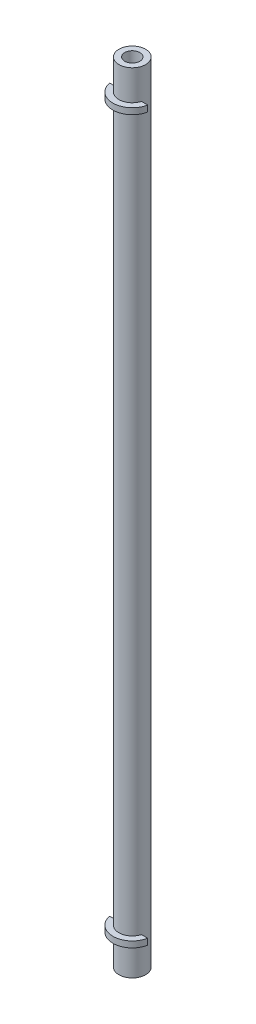
ISO-10303-21;
HEADER;
FILE_DESCRIPTION(('STEP AP214'),'2;1');
FILE_NAME('part.step','',(''),(''),'','','');
FILE_SCHEMA(('AUTOMOTIVE_DESIGN { 1 0 10303 214 1 1 1 1 }'));
ENDSEC;
DATA;
#1=APPLICATION_CONTEXT('core data for automotive mechanical design processes');
#2=APPLICATION_PROTOCOL_DEFINITION('international standard','automotive_design',2000,#1);
#3=PRODUCT_CONTEXT('',#1,'mechanical');
#4=PRODUCT('Part','Part','',(#3));
#5=PRODUCT_RELATED_PRODUCT_CATEGORY('part','',(#4));
#6=PRODUCT_DEFINITION_FORMATION('','',#4);
#7=PRODUCT_DEFINITION_CONTEXT('part definition',#1,'design');
#8=PRODUCT_DEFINITION('design','',#6,#7);
#9=PRODUCT_DEFINITION_SHAPE('','',#8);
#10=(LENGTH_UNIT() NAMED_UNIT(*) SI_UNIT(.MILLI.,.METRE.));
#11=(NAMED_UNIT(*) PLANE_ANGLE_UNIT() SI_UNIT($,.RADIAN.));
#12=(NAMED_UNIT(*) SI_UNIT($,.STERADIAN.) SOLID_ANGLE_UNIT());
#13=UNCERTAINTY_MEASURE_WITH_UNIT(LENGTH_MEASURE(1.E-05),#10,'distance_accuracy_value','');
#14=(GEOMETRIC_REPRESENTATION_CONTEXT(3) GLOBAL_UNCERTAINTY_ASSIGNED_CONTEXT((#13)) GLOBAL_UNIT_ASSIGNED_CONTEXT((#10,
#11,#12)) REPRESENTATION_CONTEXT('',''));
#15=CARTESIAN_POINT('',(0.,0.,0.));
#16=DIRECTION('',(0.,0.,1.));
#17=DIRECTION('',(1.,0.,0.));
#18=AXIS2_PLACEMENT_3D('',#15,#16,#17);
#19=CARTESIAN_POINT('',(0.,165.1,0.));
#20=DIRECTION('',(0.,-1.,0.));
#21=DIRECTION('',(0.,0.,-1.));
#22=AXIS2_PLACEMENT_3D('',#19,#20,#21);
#23=CYLINDRICAL_SURFACE('',#22,2.794);
#24=CARTESIAN_POINT('',(0.,7.62,0.));
#25=DIRECTION('',(0.,1.,0.));
#26=DIRECTION('',(0.,0.,-1.));
#27=AXIS2_PLACEMENT_3D('',#24,#25,#26);
#28=CIRCLE('',#27,2.794);
#29=CARTESIAN_POINT('',(-2.68808333204162,7.62,0.762000000000001));
#30=VERTEX_POINT('',#29);
#31=CARTESIAN_POINT('',(2.68808333204162,7.62,0.762));
#32=VERTEX_POINT('',#31);
#33=EDGE_CURVE('E167',#30,#32,#28,.T.);
#34=ORIENTED_EDGE('',*,*,#33,.T.);
#35=DIRECTION('',(0.,-1.,0.));
#36=VECTOR('',#35,1.);
#37=CARTESIAN_POINT('',(2.68808333204162,7.62,0.762));
#38=LINE('',#37,#36);
#39=CARTESIAN_POINT('',(2.68808333204162,6.35,0.762));
#40=VERTEX_POINT('',#39);
#41=EDGE_CURVE('E190',#32,#40,#38,.T.);
#42=ORIENTED_EDGE('',*,*,#41,.T.);
#43=CARTESIAN_POINT('',(0.,6.35,0.));
#44=DIRECTION('',(0.,1.,0.));
#45=DIRECTION('',(0.,0.,-1.));
#46=AXIS2_PLACEMENT_3D('',#43,#44,#45);
#47=CIRCLE('',#46,2.794);
#48=CARTESIAN_POINT('',(-2.68808333204162,6.34999999999999,0.762));
#49=VERTEX_POINT('',#48);
#50=EDGE_CURVE('E180',#49,#40,#47,.T.);
#51=ORIENTED_EDGE('',*,*,#50,.F.);
#52=DIRECTION('',(0.,-1.,0.));
#53=VECTOR('',#52,1.);
#54=CARTESIAN_POINT('',(-2.68808333204162,7.62,0.762000000000001));
#55=LINE('',#54,#53);
#56=EDGE_CURVE('E194',#30,#49,#55,.T.);
#57=ORIENTED_EDGE('',*,*,#56,.F.);
#58=EDGE_LOOP('',(#34,#42,#51,#57));
#59=FACE_BOUND('',#58,.T.);
#60=CARTESIAN_POINT('',(0.,165.1,0.));
#61=DIRECTION('',(0.,1.,0.));
#62=DIRECTION('',(0.,0.,1.));
#63=AXIS2_PLACEMENT_3D('',#60,#61,#62);
#64=CIRCLE('',#63,2.794);
#65=CARTESIAN_POINT('',(0.,165.1,2.794));
#66=VERTEX_POINT('',#65);
#67=EDGE_CURVE('E11',#66,#66,#64,.T.);
#68=ORIENTED_EDGE('',*,*,#67,.F.);
#69=EDGE_LOOP('',(#68));
#70=FACE_BOUND('',#69,.T.);
#71=CARTESIAN_POINT('',(0.,0.,0.));
#72=DIRECTION('',(0.,1.,0.));
#73=DIRECTION('',(0.,0.,1.));
#74=AXIS2_PLACEMENT_3D('',#71,#72,#73);
#75=CIRCLE('',#74,2.794);
#76=CARTESIAN_POINT('',(0.,0.,2.794));
#77=VERTEX_POINT('',#76);
#78=EDGE_CURVE('E42',#77,#77,#75,.T.);
#79=ORIENTED_EDGE('',*,*,#78,.T.);
#80=EDGE_LOOP('',(#79));
#81=FACE_BOUND('',#80,.T.);
#82=CARTESIAN_POINT('',(0.,157.48,0.));
#83=DIRECTION('',(0.,1.,0.));
#84=DIRECTION('',(0.,0.,-1.));
#85=AXIS2_PLACEMENT_3D('',#82,#83,#84);
#86=CIRCLE('',#85,2.794);
#87=CARTESIAN_POINT('',(-2.68808333204162,157.48,0.762000000000001));
#88=VERTEX_POINT('',#87);
#89=CARTESIAN_POINT('',(2.68808333204162,157.48,0.762));
#90=VERTEX_POINT('',#89);
#91=EDGE_CURVE('E113',#88,#90,#86,.T.);
#92=ORIENTED_EDGE('',*,*,#91,.F.);
#93=DIRECTION('',(0.,1.,0.));
#94=VECTOR('',#93,1.);
#95=CARTESIAN_POINT('',(-2.68808333204162,157.48,0.762000000000001));
#96=LINE('',#95,#94);
#97=CARTESIAN_POINT('',(-2.68808333204162,158.75,0.762000000000001));
#98=VERTEX_POINT('',#97);
#99=EDGE_CURVE('E152',#88,#98,#96,.T.);
#100=ORIENTED_EDGE('',*,*,#99,.T.);
#101=CARTESIAN_POINT('',(0.,158.75,0.));
#102=DIRECTION('',(0.,1.,0.));
#103=DIRECTION('',(0.,0.,-1.));
#104=AXIS2_PLACEMENT_3D('',#101,#102,#103);
#105=CIRCLE('',#104,2.794);
#106=CARTESIAN_POINT('',(2.68808333204162,158.75,0.762));
#107=VERTEX_POINT('',#106);
#108=EDGE_CURVE('E134',#98,#107,#105,.T.);
#109=ORIENTED_EDGE('',*,*,#108,.T.);
#110=DIRECTION('',(0.,1.,0.));
#111=VECTOR('',#110,1.);
#112=CARTESIAN_POINT('',(2.68808333204162,157.48,0.762));
#113=LINE('',#112,#111);
#114=EDGE_CURVE('E124',#90,#107,#113,.T.);
#115=ORIENTED_EDGE('',*,*,#114,.F.);
#116=EDGE_LOOP('',(#92,#100,#109,#115));
#117=FACE_BOUND('',#116,.T.);
#118=ADVANCED_FACE('F39',(#59,#70,#81,#117),#23,.T.);
#119=CARTESIAN_POINT('',(0.,165.1,0.));
#120=DIRECTION('',(0.,1.,0.));
#121=DIRECTION('',(0.,0.,1.));
#122=AXIS2_PLACEMENT_3D('',#119,#120,#121);
#123=PLANE('',#122);
#124=ORIENTED_EDGE('',*,*,#67,.T.);
#125=EDGE_LOOP('',(#124));
#126=FACE_BOUND('',#125,.T.);
#127=CARTESIAN_POINT('',(0.,165.1,0.));
#128=DIRECTION('',(0.,1.,0.));
#129=DIRECTION('',(0.,0.,1.));
#130=AXIS2_PLACEMENT_3D('',#127,#128,#129);
#131=CIRCLE('',#130,1.5875);
#132=CARTESIAN_POINT('',(0.,165.1,1.5875));
#133=VERTEX_POINT('',#132);
#134=EDGE_CURVE('E199',#133,#133,#131,.T.);
#135=ORIENTED_EDGE('',*,*,#134,.F.);
#136=EDGE_LOOP('',(#135));
#137=FACE_BOUND('',#136,.T.);
#138=ADVANCED_FACE('F221',(#126,#137),#123,.T.);
#139=CARTESIAN_POINT('',(0.,0.,0.));
#140=DIRECTION('',(0.,1.,0.));
#141=DIRECTION('',(0.,0.,1.));
#142=AXIS2_PLACEMENT_3D('',#139,#140,#141);
#143=PLANE('',#142);
#144=ORIENTED_EDGE('',*,*,#78,.F.);
#145=EDGE_LOOP('',(#144));
#146=FACE_BOUND('',#145,.T.);
#147=CARTESIAN_POINT('',(0.,0.,0.));
#148=DIRECTION('',(0.,1.,0.));
#149=DIRECTION('',(0.,0.,1.));
#150=AXIS2_PLACEMENT_3D('',#147,#148,#149);
#151=CIRCLE('',#150,1.5875);
#152=CARTESIAN_POINT('',(0.,0.,1.5875));
#153=VERTEX_POINT('',#152);
#154=EDGE_CURVE('E189',#153,#153,#151,.T.);
#155=ORIENTED_EDGE('',*,*,#154,.T.);
#156=EDGE_LOOP('',(#155));
#157=FACE_BOUND('',#156,.T.);
#158=ADVANCED_FACE('F207',(#146,#157),#143,.F.);
#159=CARTESIAN_POINT('',(0.,165.1,0.));
#160=DIRECTION('',(0.,-1.,0.));
#161=DIRECTION('',(0.,0.,-1.));
#162=AXIS2_PLACEMENT_3D('',#159,#160,#161);
#163=CYLINDRICAL_SURFACE('',#162,1.5875);
#164=ORIENTED_EDGE('',*,*,#134,.T.);
#165=EDGE_LOOP('',(#164));
#166=FACE_BOUND('',#165,.T.);
#167=ORIENTED_EDGE('',*,*,#154,.F.);
#168=EDGE_LOOP('',(#167));
#169=FACE_BOUND('',#168,.T.);
#170=ADVANCED_FACE('F209',(#166,#169),#163,.F.);
#171=CARTESIAN_POINT('',(0.,7.62,0.));
#172=DIRECTION('',(0.,-1.,0.));
#173=DIRECTION('',(0.,0.,-1.));
#174=AXIS2_PLACEMENT_3D('',#171,#172,#173);
#175=CYLINDRICAL_SURFACE('',#174,4.064);
#176=CARTESIAN_POINT('',(0.,6.35,0.));
#177=DIRECTION('',(0.,-1.,0.));
#178=DIRECTION('',(0.,0.,-1.));
#179=AXIS2_PLACEMENT_3D('',#176,#177,#178);
#180=CIRCLE('',#179,4.064);
#181=CARTESIAN_POINT('',(3.99192334595743,6.35,0.762));
#182=VERTEX_POINT('',#181);
#183=CARTESIAN_POINT('',(-3.99192334595743,6.35,0.762));
#184=VERTEX_POINT('',#183);
#185=EDGE_CURVE('E151',#182,#184,#180,.T.);
#186=ORIENTED_EDGE('',*,*,#185,.F.);
#187=DIRECTION('',(0.,-1.,0.));
#188=VECTOR('',#187,1.);
#189=CARTESIAN_POINT('',(3.99192334595743,7.62,0.762));
#190=LINE('',#189,#188);
#191=CARTESIAN_POINT('',(3.99192334595743,7.62,0.762));
#192=VERTEX_POINT('',#191);
#193=EDGE_CURVE('E186',#192,#182,#190,.T.);
#194=ORIENTED_EDGE('',*,*,#193,.F.);
#195=CARTESIAN_POINT('',(0.,7.62,0.));
#196=DIRECTION('',(0.,-1.,0.));
#197=DIRECTION('',(0.,0.,-1.));
#198=AXIS2_PLACEMENT_3D('',#195,#196,#197);
#199=CIRCLE('',#198,4.064);
#200=CARTESIAN_POINT('',(-3.99192334595743,7.62,0.762));
#201=VERTEX_POINT('',#200);
#202=EDGE_CURVE('E158',#192,#201,#199,.T.);
#203=ORIENTED_EDGE('',*,*,#202,.T.);
#204=DIRECTION('',(0.,-1.,0.));
#205=VECTOR('',#204,1.);
#206=CARTESIAN_POINT('',(-3.99192334595743,7.62,0.762));
#207=LINE('',#206,#205);
#208=EDGE_CURVE('E175',#201,#184,#207,.T.);
#209=ORIENTED_EDGE('',*,*,#208,.T.);
#210=EDGE_LOOP('',(#186,#194,#203,#209));
#211=FACE_BOUND('',#210,.T.);
#212=ADVANCED_FACE('F211',(#211),#175,.T.);
#213=CARTESIAN_POINT('',(3.99192334595743,7.62,0.762));
#214=DIRECTION('',(0.,0.,-1.));
#215=DIRECTION('',(-1.,0.,0.));
#216=AXIS2_PLACEMENT_3D('',#213,#214,#215);
#217=PLANE('',#216);
#218=DIRECTION('',(1.,0.,0.));
#219=VECTOR('',#218,1.);
#220=CARTESIAN_POINT('',(3.99192334595743,6.35,0.762));
#221=LINE('',#220,#219);
#222=EDGE_CURVE('E163',#40,#182,#221,.T.);
#223=ORIENTED_EDGE('',*,*,#222,.F.);
#224=ORIENTED_EDGE('',*,*,#41,.F.);
#225=DIRECTION('',(1.,0.,0.));
#226=VECTOR('',#225,1.);
#227=CARTESIAN_POINT('',(3.99192334595743,7.62,0.762));
#228=LINE('',#227,#226);
#229=EDGE_CURVE('E171',#32,#192,#228,.T.);
#230=ORIENTED_EDGE('',*,*,#229,.T.);
#231=ORIENTED_EDGE('',*,*,#193,.T.);
#232=EDGE_LOOP('',(#223,#224,#230,#231));
#233=FACE_BOUND('',#232,.T.);
#234=ADVANCED_FACE('F218',(#233),#217,.T.);
#235=CARTESIAN_POINT('',(-2.68808333204162,7.62,0.762));
#236=DIRECTION('',(0.,0.,-1.));
#237=DIRECTION('',(-1.,0.,0.));
#238=AXIS2_PLACEMENT_3D('',#235,#236,#237);
#239=PLANE('',#238);
#240=DIRECTION('',(1.,0.,0.));
#241=VECTOR('',#240,1.);
#242=CARTESIAN_POINT('',(-2.68808333204162,6.35,0.762));
#243=LINE('',#242,#241);
#244=EDGE_CURVE('E62',#184,#49,#243,.T.);
#245=ORIENTED_EDGE('',*,*,#244,.F.);
#246=ORIENTED_EDGE('',*,*,#208,.F.);
#247=DIRECTION('',(1.,0.,0.));
#248=VECTOR('',#247,1.);
#249=CARTESIAN_POINT('',(-2.68808333204162,7.62,0.762));
#250=LINE('',#249,#248);
#251=EDGE_CURVE('E162',#201,#30,#250,.T.);
#252=ORIENTED_EDGE('',*,*,#251,.T.);
#253=ORIENTED_EDGE('',*,*,#56,.T.);
#254=EDGE_LOOP('',(#245,#246,#252,#253));
#255=FACE_BOUND('',#254,.T.);
#256=ADVANCED_FACE('F256',(#255),#239,.T.);
#257=CARTESIAN_POINT('',(0.,7.62,0.));
#258=DIRECTION('',(0.,-1.,0.));
#259=DIRECTION('',(0.,0.,-1.));
#260=AXIS2_PLACEMENT_3D('',#257,#258,#259);
#261=PLANE('',#260);
#262=ORIENTED_EDGE('',*,*,#202,.F.);
#263=ORIENTED_EDGE('',*,*,#229,.F.);
#264=ORIENTED_EDGE('',*,*,#33,.F.);
#265=ORIENTED_EDGE('',*,*,#251,.F.);
#266=EDGE_LOOP('',(#262,#263,#264,#265));
#267=FACE_BOUND('',#266,.T.);
#268=ADVANCED_FACE('F253',(#267),#261,.F.);
#269=CARTESIAN_POINT('',(0.,6.35,0.));
#270=DIRECTION('',(0.,-1.,0.));
#271=DIRECTION('',(0.,0.,-1.));
#272=AXIS2_PLACEMENT_3D('',#269,#270,#271);
#273=PLANE('',#272);
#274=ORIENTED_EDGE('',*,*,#185,.T.);
#275=ORIENTED_EDGE('',*,*,#244,.T.);
#276=ORIENTED_EDGE('',*,*,#50,.T.);
#277=ORIENTED_EDGE('',*,*,#222,.T.);
#278=EDGE_LOOP('',(#274,#275,#276,#277));
#279=FACE_BOUND('',#278,.T.);
#280=ADVANCED_FACE('F248',(#279),#273,.T.);
#281=CARTESIAN_POINT('',(0.,157.48,0.));
#282=DIRECTION('',(0.,1.,0.));
#283=DIRECTION('',(0.,0.,1.));
#284=AXIS2_PLACEMENT_3D('',#281,#282,#283);
#285=CYLINDRICAL_SURFACE('',#284,4.064);
#286=CARTESIAN_POINT('',(0.,158.75,0.));
#287=DIRECTION('',(0.,-1.,0.));
#288=DIRECTION('',(0.,0.,-1.));
#289=AXIS2_PLACEMENT_3D('',#286,#287,#288);
#290=CIRCLE('',#289,4.064);
#291=CARTESIAN_POINT('',(3.99192334595743,158.75,0.762));
#292=VERTEX_POINT('',#291);
#293=CARTESIAN_POINT('',(-3.99192334595743,158.75,0.762));
#294=VERTEX_POINT('',#293);
#295=EDGE_CURVE('E141',#292,#294,#290,.T.);
#296=ORIENTED_EDGE('',*,*,#295,.T.);
#297=DIRECTION('',(0.,1.,0.));
#298=VECTOR('',#297,1.);
#299=CARTESIAN_POINT('',(-3.99192334595743,157.48,0.762));
#300=LINE('',#299,#298);
#301=CARTESIAN_POINT('',(-3.99192334595743,157.48,0.762));
#302=VERTEX_POINT('',#301);
#303=EDGE_CURVE('E129',#302,#294,#300,.T.);
#304=ORIENTED_EDGE('',*,*,#303,.F.);
#305=CARTESIAN_POINT('',(0.,157.48,0.));
#306=DIRECTION('',(0.,-1.,0.));
#307=DIRECTION('',(0.,0.,-1.));
#308=AXIS2_PLACEMENT_3D('',#305,#306,#307);
#309=CIRCLE('',#308,4.064);
#310=CARTESIAN_POINT('',(3.99192334595743,157.48,0.762));
#311=VERTEX_POINT('',#310);
#312=EDGE_CURVE('E110',#311,#302,#309,.T.);
#313=ORIENTED_EDGE('',*,*,#312,.F.);
#314=DIRECTION('',(0.,1.,0.));
#315=VECTOR('',#314,1.);
#316=CARTESIAN_POINT('',(3.99192334595743,157.48,0.762));
#317=LINE('',#316,#315);
#318=EDGE_CURVE('E119',#311,#292,#317,.T.);
#319=ORIENTED_EDGE('',*,*,#318,.T.);
#320=EDGE_LOOP('',(#296,#304,#313,#319));
#321=FACE_BOUND('',#320,.T.);
#322=ADVANCED_FACE('F127',(#321),#285,.T.);
#323=CARTESIAN_POINT('',(-2.68808333204162,157.48,0.762));
#324=DIRECTION('',(0.,0.,1.));
#325=DIRECTION('',(1.,0.,0.));
#326=AXIS2_PLACEMENT_3D('',#323,#324,#325);
#327=PLANE('',#326);
#328=DIRECTION('',(1.,0.,0.));
#329=VECTOR('',#328,1.);
#330=CARTESIAN_POINT('',(-2.68808333204162,158.75,0.762));
#331=LINE('',#330,#329);
#332=EDGE_CURVE('E131',#294,#98,#331,.T.);
#333=ORIENTED_EDGE('',*,*,#332,.T.);
#334=ORIENTED_EDGE('',*,*,#99,.F.);
#335=DIRECTION('',(1.,0.,0.));
#336=VECTOR('',#335,1.);
#337=CARTESIAN_POINT('',(-2.68808333204162,157.48,0.762));
#338=LINE('',#337,#336);
#339=EDGE_CURVE('E125',#302,#88,#338,.T.);
#340=ORIENTED_EDGE('',*,*,#339,.F.);
#341=ORIENTED_EDGE('',*,*,#303,.T.);
#342=EDGE_LOOP('',(#333,#334,#340,#341));
#343=FACE_BOUND('',#342,.T.);
#344=ADVANCED_FACE('F240',(#343),#327,.F.);
#345=CARTESIAN_POINT('',(3.99192334595743,157.48,0.762));
#346=DIRECTION('',(0.,0.,1.));
#347=DIRECTION('',(1.,0.,0.));
#348=AXIS2_PLACEMENT_3D('',#345,#346,#347);
#349=PLANE('',#348);
#350=DIRECTION('',(1.,0.,0.));
#351=VECTOR('',#350,1.);
#352=CARTESIAN_POINT('',(3.99192334595743,158.75,0.762));
#353=LINE('',#352,#351);
#354=EDGE_CURVE('E54',#107,#292,#353,.T.);
#355=ORIENTED_EDGE('',*,*,#354,.T.);
#356=ORIENTED_EDGE('',*,*,#318,.F.);
#357=DIRECTION('',(1.,0.,0.));
#358=VECTOR('',#357,1.);
#359=CARTESIAN_POINT('',(3.99192334595743,157.48,0.762));
#360=LINE('',#359,#358);
#361=EDGE_CURVE('E106',#90,#311,#360,.T.);
#362=ORIENTED_EDGE('',*,*,#361,.F.);
#363=ORIENTED_EDGE('',*,*,#114,.T.);
#364=EDGE_LOOP('',(#355,#356,#362,#363));
#365=FACE_BOUND('',#364,.T.);
#366=ADVANCED_FACE('F120',(#365),#349,.F.);
#367=CARTESIAN_POINT('',(0.,157.48,0.));
#368=DIRECTION('',(0.,1.,0.));
#369=DIRECTION('',(0.,0.,-1.));
#370=AXIS2_PLACEMENT_3D('',#367,#368,#369);
#371=PLANE('',#370);
#372=ORIENTED_EDGE('',*,*,#312,.T.);
#373=ORIENTED_EDGE('',*,*,#339,.T.);
#374=ORIENTED_EDGE('',*,*,#91,.T.);
#375=ORIENTED_EDGE('',*,*,#361,.T.);
#376=EDGE_LOOP('',(#372,#373,#374,#375));
#377=FACE_BOUND('',#376,.T.);
#378=ADVANCED_FACE('F108',(#377),#371,.F.);
#379=CARTESIAN_POINT('',(0.,158.75,0.));
#380=DIRECTION('',(0.,1.,0.));
#381=DIRECTION('',(0.,0.,-1.));
#382=AXIS2_PLACEMENT_3D('',#379,#380,#381);
#383=PLANE('',#382);
#384=ORIENTED_EDGE('',*,*,#295,.F.);
#385=ORIENTED_EDGE('',*,*,#354,.F.);
#386=ORIENTED_EDGE('',*,*,#108,.F.);
#387=ORIENTED_EDGE('',*,*,#332,.F.);
#388=EDGE_LOOP('',(#384,#385,#386,#387));
#389=FACE_BOUND('',#388,.T.);
#390=ADVANCED_FACE('F238',(#389),#383,.T.);
#391=CLOSED_SHELL('',(#118,#138,#158,#170,#212,#234,#256,#268,#280,#322,#344,#366,#378,#390));
#392=MANIFOLD_SOLID_BREP('B2',#391);
#393=ADVANCED_BREP_SHAPE_REPRESENTATION('',(#18,#392),#14);
#394=SHAPE_DEFINITION_REPRESENTATION(#9,#393);
ENDSEC;
END-ISO-10303-21;
